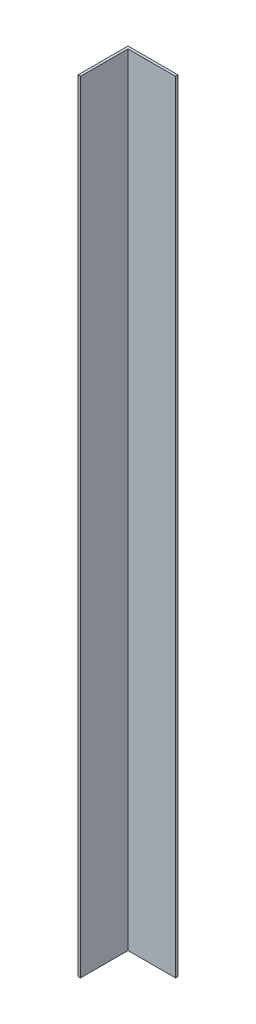
ISO-10303-21;
HEADER;
FILE_DESCRIPTION(('STEP AP214'),'2;1');
FILE_NAME('part.step','',(''),(''),'','','');
FILE_SCHEMA(('AUTOMOTIVE_DESIGN { 1 0 10303 214 1 1 1 1 }'));
ENDSEC;
DATA;
#1=APPLICATION_CONTEXT('core data for automotive mechanical design processes');
#2=APPLICATION_PROTOCOL_DEFINITION('international standard','automotive_design',2000,#1);
#3=PRODUCT_CONTEXT('',#1,'mechanical');
#4=PRODUCT('Part','Part','',(#3));
#5=PRODUCT_RELATED_PRODUCT_CATEGORY('part','',(#4));
#6=PRODUCT_DEFINITION_FORMATION('','',#4);
#7=PRODUCT_DEFINITION_CONTEXT('part definition',#1,'design');
#8=PRODUCT_DEFINITION('design','',#6,#7);
#9=PRODUCT_DEFINITION_SHAPE('','',#8);
#10=(LENGTH_UNIT() NAMED_UNIT(*) SI_UNIT(.MILLI.,.METRE.));
#11=(NAMED_UNIT(*) PLANE_ANGLE_UNIT() SI_UNIT($,.RADIAN.));
#12=(NAMED_UNIT(*) SI_UNIT($,.STERADIAN.) SOLID_ANGLE_UNIT());
#13=UNCERTAINTY_MEASURE_WITH_UNIT(LENGTH_MEASURE(1.E-05),#10,'distance_accuracy_value','');
#14=(GEOMETRIC_REPRESENTATION_CONTEXT(3) GLOBAL_UNCERTAINTY_ASSIGNED_CONTEXT((#13)) GLOBAL_UNIT_ASSIGNED_CONTEXT((#10,
#11,#12)) REPRESENTATION_CONTEXT('',''));
#15=CARTESIAN_POINT('',(0.,0.,0.));
#16=DIRECTION('',(0.,0.,1.));
#17=DIRECTION('',(1.,0.,0.));
#18=AXIS2_PLACEMENT_3D('',#15,#16,#17);
#19=CARTESIAN_POINT('',(-20.,624.,-20.1136363636364));
#20=DIRECTION('',(1.,0.,0.));
#21=DIRECTION('',(0.,0.,-1.));
#22=AXIS2_PLACEMENT_3D('',#19,#20,#21);
#23=PLANE('',#22);
#24=DIRECTION('',(0.,0.,1.));
#25=VECTOR('',#24,1.);
#26=CARTESIAN_POINT('',(-20.,0.,-20.1136363636364));
#27=LINE('',#26,#25);
#28=CARTESIAN_POINT('',(-20.,0.,-20.1136363636364));
#29=VERTEX_POINT('',#28);
#30=CARTESIAN_POINT('',(-20.,0.,19.8863636363636));
#31=VERTEX_POINT('',#30);
#32=EDGE_CURVE('E117',#29,#31,#27,.T.);
#33=ORIENTED_EDGE('',*,*,#32,.T.);
#34=DIRECTION('',(0.,-1.,0.));
#35=VECTOR('',#34,1.);
#36=CARTESIAN_POINT('',(-20.,624.,19.8863636363636));
#37=LINE('',#36,#35);
#38=CARTESIAN_POINT('',(-20.,624.,19.8863636363636));
#39=VERTEX_POINT('',#38);
#40=EDGE_CURVE('E11',#39,#31,#37,.T.);
#41=ORIENTED_EDGE('',*,*,#40,.F.);
#42=DIRECTION('',(0.,0.,1.));
#43=VECTOR('',#42,1.);
#44=CARTESIAN_POINT('',(-20.,624.,-20.1136363636364));
#45=LINE('',#44,#43);
#46=CARTESIAN_POINT('',(-20.,624.,-20.1136363636364));
#47=VERTEX_POINT('',#46);
#48=EDGE_CURVE('E127',#47,#39,#45,.T.);
#49=ORIENTED_EDGE('',*,*,#48,.F.);
#50=DIRECTION('',(0.,-1.,0.));
#51=VECTOR('',#50,1.);
#52=CARTESIAN_POINT('',(-20.,624.,-20.1136363636364));
#53=LINE('',#52,#51);
#54=EDGE_CURVE('E113',#47,#29,#53,.T.);
#55=ORIENTED_EDGE('',*,*,#54,.T.);
#56=EDGE_LOOP('',(#33,#41,#49,#55));
#57=FACE_BOUND('',#56,.T.);
#58=ADVANCED_FACE('F33',(#57),#23,.F.);
#59=CARTESIAN_POINT('',(-20.,624.,19.8863636363636));
#60=DIRECTION('',(0.,0.,-1.));
#61=DIRECTION('',(-1.,0.,0.));
#62=AXIS2_PLACEMENT_3D('',#59,#60,#61);
#63=PLANE('',#62);
#64=DIRECTION('',(1.,0.,0.));
#65=VECTOR('',#64,1.);
#66=CARTESIAN_POINT('',(-20.,0.,19.8863636363636));
#67=LINE('',#66,#65);
#68=CARTESIAN_POINT('',(-18.,0.,19.8863636363636));
#69=VERTEX_POINT('',#68);
#70=EDGE_CURVE('E120',#31,#69,#67,.T.);
#71=ORIENTED_EDGE('',*,*,#70,.T.);
#72=DIRECTION('',(0.,-1.,0.));
#73=VECTOR('',#72,1.);
#74=CARTESIAN_POINT('',(-18.,624.,19.8863636363636));
#75=LINE('',#74,#73);
#76=CARTESIAN_POINT('',(-18.,624.,19.8863636363636));
#77=VERTEX_POINT('',#76);
#78=EDGE_CURVE('E41',#77,#69,#75,.T.);
#79=ORIENTED_EDGE('',*,*,#78,.F.);
#80=DIRECTION('',(1.,0.,0.));
#81=VECTOR('',#80,1.);
#82=CARTESIAN_POINT('',(-20.,624.,19.8863636363636));
#83=LINE('',#82,#81);
#84=EDGE_CURVE('E86',#39,#77,#83,.T.);
#85=ORIENTED_EDGE('',*,*,#84,.F.);
#86=ORIENTED_EDGE('',*,*,#40,.T.);
#87=EDGE_LOOP('',(#71,#79,#85,#86));
#88=FACE_BOUND('',#87,.T.);
#89=ADVANCED_FACE('F151',(#88),#63,.F.);
#90=CARTESIAN_POINT('',(-18.,624.,-18.1136363636364));
#91=DIRECTION('',(-1.,0.,0.));
#92=DIRECTION('',(0.,0.,1.));
#93=AXIS2_PLACEMENT_3D('',#90,#91,#92);
#94=PLANE('',#93);
#95=DIRECTION('',(0.,0.,-1.));
#96=VECTOR('',#95,1.);
#97=CARTESIAN_POINT('',(-18.,0.,-18.1136363636364));
#98=LINE('',#97,#96);
#99=CARTESIAN_POINT('',(-18.,0.,-18.1136363636364));
#100=VERTEX_POINT('',#99);
#101=EDGE_CURVE('E122',#69,#100,#98,.T.);
#102=ORIENTED_EDGE('',*,*,#101,.T.);
#103=DIRECTION('',(0.,-1.,0.));
#104=VECTOR('',#103,1.);
#105=CARTESIAN_POINT('',(-18.,624.,-18.1136363636364));
#106=LINE('',#105,#104);
#107=CARTESIAN_POINT('',(-18.,624.,-18.1136363636364));
#108=VERTEX_POINT('',#107);
#109=EDGE_CURVE('E108',#108,#100,#106,.T.);
#110=ORIENTED_EDGE('',*,*,#109,.F.);
#111=DIRECTION('',(0.,0.,-1.));
#112=VECTOR('',#111,1.);
#113=CARTESIAN_POINT('',(-18.,624.,-18.1136363636364));
#114=LINE('',#113,#112);
#115=EDGE_CURVE('E99',#77,#108,#114,.T.);
#116=ORIENTED_EDGE('',*,*,#115,.F.);
#117=ORIENTED_EDGE('',*,*,#78,.T.);
#118=EDGE_LOOP('',(#102,#110,#116,#117));
#119=FACE_BOUND('',#118,.T.);
#120=ADVANCED_FACE('F133',(#119),#94,.F.);
#121=CARTESIAN_POINT('',(-18.,624.,-18.1136363636364));
#122=DIRECTION('',(0.,0.,-1.));
#123=DIRECTION('',(-1.,0.,0.));
#124=AXIS2_PLACEMENT_3D('',#121,#122,#123);
#125=PLANE('',#124);
#126=DIRECTION('',(1.,0.,0.));
#127=VECTOR('',#126,1.);
#128=CARTESIAN_POINT('',(-18.,0.,-18.1136363636364));
#129=LINE('',#128,#127);
#130=CARTESIAN_POINT('',(20.,0.,-18.1136363636364));
#131=VERTEX_POINT('',#130);
#132=EDGE_CURVE('E107',#100,#131,#129,.T.);
#133=ORIENTED_EDGE('',*,*,#132,.T.);
#134=DIRECTION('',(0.,-1.,0.));
#135=VECTOR('',#134,1.);
#136=CARTESIAN_POINT('',(20.,624.,-18.1136363636364));
#137=LINE('',#136,#135);
#138=CARTESIAN_POINT('',(20.,624.,-18.1136363636364));
#139=VERTEX_POINT('',#138);
#140=EDGE_CURVE('E104',#139,#131,#137,.T.);
#141=ORIENTED_EDGE('',*,*,#140,.F.);
#142=DIRECTION('',(1.,0.,0.));
#143=VECTOR('',#142,1.);
#144=CARTESIAN_POINT('',(-18.,624.,-18.1136363636364));
#145=LINE('',#144,#143);
#146=EDGE_CURVE('E93',#108,#139,#145,.T.);
#147=ORIENTED_EDGE('',*,*,#146,.F.);
#148=ORIENTED_EDGE('',*,*,#109,.T.);
#149=EDGE_LOOP('',(#133,#141,#147,#148));
#150=FACE_BOUND('',#149,.T.);
#151=ADVANCED_FACE('F105',(#150),#125,.F.);
#152=CARTESIAN_POINT('',(20.,624.,-20.1136363636364));
#153=DIRECTION('',(-1.,0.,0.));
#154=DIRECTION('',(0.,0.,1.));
#155=AXIS2_PLACEMENT_3D('',#152,#153,#154);
#156=PLANE('',#155);
#157=DIRECTION('',(0.,0.,-1.));
#158=VECTOR('',#157,1.);
#159=CARTESIAN_POINT('',(20.,0.,-20.1136363636364));
#160=LINE('',#159,#158);
#161=CARTESIAN_POINT('',(20.,0.,-20.1136363636364));
#162=VERTEX_POINT('',#161);
#163=EDGE_CURVE('E72',#131,#162,#160,.T.);
#164=ORIENTED_EDGE('',*,*,#163,.T.);
#165=DIRECTION('',(0.,-1.,0.));
#166=VECTOR('',#165,1.);
#167=CARTESIAN_POINT('',(20.,624.,-20.1136363636364));
#168=LINE('',#167,#166);
#169=CARTESIAN_POINT('',(20.,624.,-20.1136363636364));
#170=VERTEX_POINT('',#169);
#171=EDGE_CURVE('E109',#170,#162,#168,.T.);
#172=ORIENTED_EDGE('',*,*,#171,.F.);
#173=DIRECTION('',(0.,0.,-1.));
#174=VECTOR('',#173,1.);
#175=CARTESIAN_POINT('',(20.,624.,-20.1136363636364));
#176=LINE('',#175,#174);
#177=EDGE_CURVE('E97',#139,#170,#176,.T.);
#178=ORIENTED_EDGE('',*,*,#177,.F.);
#179=ORIENTED_EDGE('',*,*,#140,.T.);
#180=EDGE_LOOP('',(#164,#172,#178,#179));
#181=FACE_BOUND('',#180,.T.);
#182=ADVANCED_FACE('F111',(#181),#156,.F.);
#183=CARTESIAN_POINT('',(-20.,624.,-20.1136363636364));
#184=DIRECTION('',(0.,0.,1.));
#185=DIRECTION('',(1.,0.,0.));
#186=AXIS2_PLACEMENT_3D('',#183,#184,#185);
#187=PLANE('',#186);
#188=DIRECTION('',(-1.,0.,0.));
#189=VECTOR('',#188,1.);
#190=CARTESIAN_POINT('',(-20.,0.,-20.1136363636364));
#191=LINE('',#190,#189);
#192=EDGE_CURVE('E78',#162,#29,#191,.T.);
#193=ORIENTED_EDGE('',*,*,#192,.T.);
#194=ORIENTED_EDGE('',*,*,#54,.F.);
#195=DIRECTION('',(-1.,0.,0.));
#196=VECTOR('',#195,1.);
#197=CARTESIAN_POINT('',(-20.,624.,-20.1136363636364));
#198=LINE('',#197,#196);
#199=EDGE_CURVE('E49',#170,#47,#198,.T.);
#200=ORIENTED_EDGE('',*,*,#199,.F.);
#201=ORIENTED_EDGE('',*,*,#171,.T.);
#202=EDGE_LOOP('',(#193,#194,#200,#201));
#203=FACE_BOUND('',#202,.T.);
#204=ADVANCED_FACE('F140',(#203),#187,.F.);
#205=CARTESIAN_POINT('',(0.,624.,0.));
#206=DIRECTION('',(0.,1.,0.));
#207=DIRECTION('',(0.,0.,1.));
#208=AXIS2_PLACEMENT_3D('',#205,#206,#207);
#209=PLANE('',#208);
#210=ORIENTED_EDGE('',*,*,#48,.T.);
#211=ORIENTED_EDGE('',*,*,#84,.T.);
#212=ORIENTED_EDGE('',*,*,#115,.T.);
#213=ORIENTED_EDGE('',*,*,#146,.T.);
#214=ORIENTED_EDGE('',*,*,#177,.T.);
#215=ORIENTED_EDGE('',*,*,#199,.T.);
#216=EDGE_LOOP('',(#210,#211,#212,#213,#214,#215));
#217=FACE_BOUND('',#216,.T.);
#218=ADVANCED_FACE('F95',(#217),#209,.T.);
#219=CARTESIAN_POINT('',(0.,0.,0.));
#220=DIRECTION('',(0.,1.,0.));
#221=DIRECTION('',(0.,0.,1.));
#222=AXIS2_PLACEMENT_3D('',#219,#220,#221);
#223=PLANE('',#222);
#224=ORIENTED_EDGE('',*,*,#32,.F.);
#225=ORIENTED_EDGE('',*,*,#192,.F.);
#226=ORIENTED_EDGE('',*,*,#163,.F.);
#227=ORIENTED_EDGE('',*,*,#132,.F.);
#228=ORIENTED_EDGE('',*,*,#101,.F.);
#229=ORIENTED_EDGE('',*,*,#70,.F.);
#230=EDGE_LOOP('',(#224,#225,#226,#227,#228,#229));
#231=FACE_BOUND('',#230,.T.);
#232=ADVANCED_FACE('F136',(#231),#223,.F.);
#233=CLOSED_SHELL('',(#58,#89,#120,#151,#182,#204,#218,#232));
#234=MANIFOLD_SOLID_BREP('B2',#233);
#235=ADVANCED_BREP_SHAPE_REPRESENTATION('',(#18,#234),#14);
#236=SHAPE_DEFINITION_REPRESENTATION(#9,#235);
ENDSEC;
END-ISO-10303-21;
